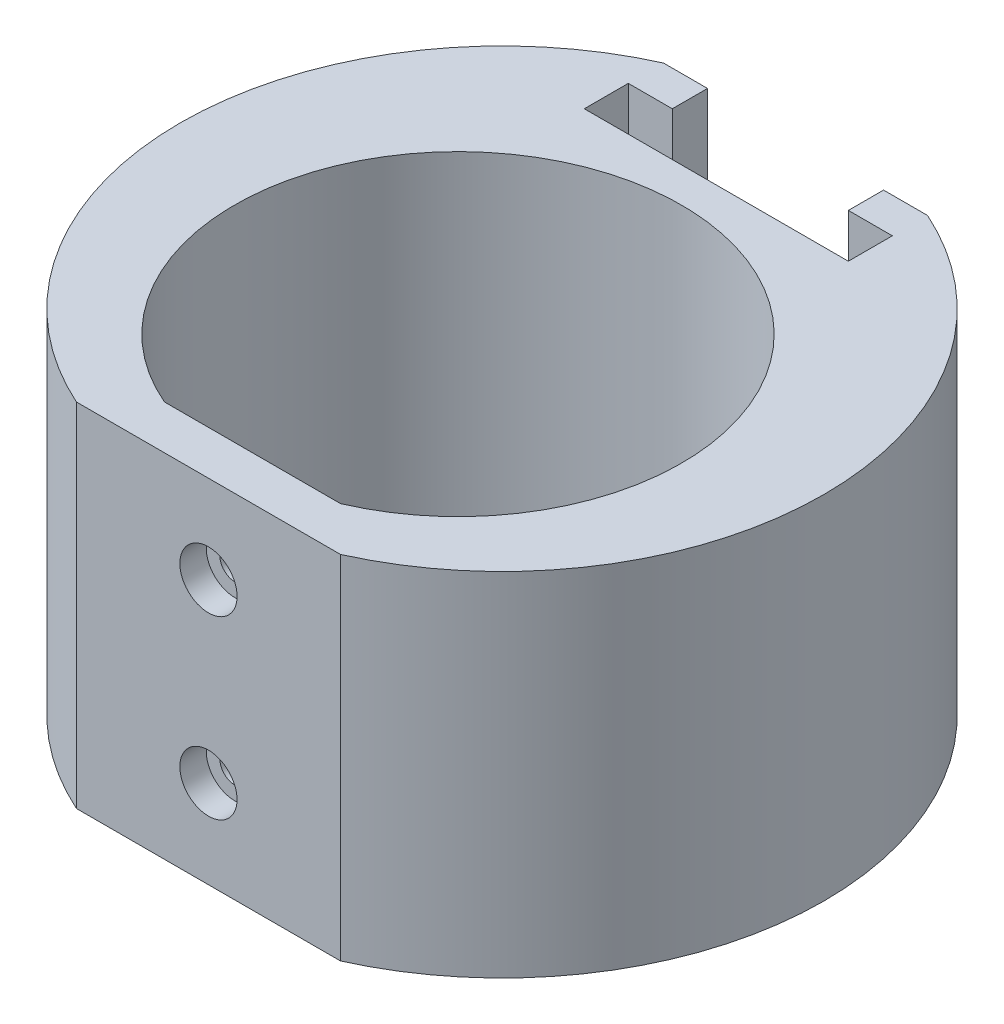
ISO-10303-21;
HEADER;
FILE_DESCRIPTION(('STEP AP214'),'2;1');
FILE_NAME('part.step','',(''),(''),'','','');
FILE_SCHEMA(('AUTOMOTIVE_DESIGN { 1 0 10303 214 1 1 1 1 }'));
ENDSEC;
DATA;
#1=APPLICATION_CONTEXT('core data for automotive mechanical design processes');
#2=APPLICATION_PROTOCOL_DEFINITION('international standard','automotive_design',2000,#1);
#3=PRODUCT_CONTEXT('',#1,'mechanical');
#4=PRODUCT('Part','Part','',(#3));
#5=PRODUCT_RELATED_PRODUCT_CATEGORY('part','',(#4));
#6=PRODUCT_DEFINITION_FORMATION('','',#4);
#7=PRODUCT_DEFINITION_CONTEXT('part definition',#1,'design');
#8=PRODUCT_DEFINITION('design','',#6,#7);
#9=PRODUCT_DEFINITION_SHAPE('','',#8);
#10=(LENGTH_UNIT() NAMED_UNIT(*) SI_UNIT(.MILLI.,.METRE.));
#11=(NAMED_UNIT(*) PLANE_ANGLE_UNIT() SI_UNIT($,.RADIAN.));
#12=(NAMED_UNIT(*) SI_UNIT($,.STERADIAN.) SOLID_ANGLE_UNIT());
#13=UNCERTAINTY_MEASURE_WITH_UNIT(LENGTH_MEASURE(1.E-05),#10,'distance_accuracy_value','');
#14=(GEOMETRIC_REPRESENTATION_CONTEXT(3) GLOBAL_UNCERTAINTY_ASSIGNED_CONTEXT((#13)) GLOBAL_UNIT_ASSIGNED_CONTEXT((#10,
#11,#12)) REPRESENTATION_CONTEXT('',''));
#15=CARTESIAN_POINT('',(0.,0.,0.));
#16=DIRECTION('',(0.,0.,1.));
#17=DIRECTION('',(1.,0.,0.));
#18=AXIS2_PLACEMENT_3D('',#15,#16,#17);
#19=CARTESIAN_POINT('',(0.,20.,-5.));
#20=DIRECTION('',(0.,1.,0.));
#21=DIRECTION('',(0.,0.,1.));
#22=AXIS2_PLACEMENT_3D('',#19,#20,#21);
#23=PLANE('',#22);
#24=DIRECTION('',(0.,0.,-1.));
#25=VECTOR('',#24,1.);
#26=CARTESIAN_POINT('',(10.,20.,-34.3486616318795));
#27=LINE('',#26,#25);
#28=CARTESIAN_POINT('',(10.,20.,-34.3486616318795));
#29=VERTEX_POINT('',#28);
#30=CARTESIAN_POINT('',(10.,20.,-38.3486616318795));
#31=VERTEX_POINT('',#30);
#32=EDGE_CURVE('E210',#29,#31,#27,.T.);
#33=ORIENTED_EDGE('',*,*,#32,.F.);
#34=DIRECTION('',(-1.,0.,0.));
#35=VECTOR('',#34,1.);
#36=CARTESIAN_POINT('',(15.,20.,-34.3486616318794));
#37=LINE('',#36,#35);
#38=CARTESIAN_POINT('',(15.,20.,-34.3486616318794));
#39=VERTEX_POINT('',#38);
#40=EDGE_CURVE('E233',#39,#29,#37,.T.);
#41=ORIENTED_EDGE('',*,*,#40,.F.);
#42=DIRECTION('',(0.,0.,-1.));
#43=VECTOR('',#42,1.);
#44=CARTESIAN_POINT('',(15.,20.,-29.3486616318794));
#45=LINE('',#44,#43);
#46=CARTESIAN_POINT('',(15.,20.,-29.3486616318794));
#47=VERTEX_POINT('',#46);
#48=EDGE_CURVE('E230',#47,#39,#45,.T.);
#49=ORIENTED_EDGE('',*,*,#48,.F.);
#50=DIRECTION('',(1.,0.,0.));
#51=VECTOR('',#50,1.);
#52=CARTESIAN_POINT('',(-15.,20.,-29.3486616318794));
#53=LINE('',#52,#51);
#54=CARTESIAN_POINT('',(-15.,20.,-29.3486616318794));
#55=VERTEX_POINT('',#54);
#56=EDGE_CURVE('E227',#55,#47,#53,.T.);
#57=ORIENTED_EDGE('',*,*,#56,.F.);
#58=DIRECTION('',(0.,0.,1.));
#59=VECTOR('',#58,1.);
#60=CARTESIAN_POINT('',(-15.,20.,-34.3486616318794));
#61=LINE('',#60,#59);
#62=CARTESIAN_POINT('',(-15.,20.,-34.3486616318794));
#63=VERTEX_POINT('',#62);
#64=EDGE_CURVE('E224',#63,#55,#61,.T.);
#65=ORIENTED_EDGE('',*,*,#64,.F.);
#66=DIRECTION('',(-1.,0.,0.));
#67=VECTOR('',#66,1.);
#68=CARTESIAN_POINT('',(-10.,20.,-34.3486616318795));
#69=LINE('',#68,#67);
#70=CARTESIAN_POINT('',(-10.,20.,-34.3486616318795));
#71=VERTEX_POINT('',#70);
#72=EDGE_CURVE('E221',#71,#63,#69,.T.);
#73=ORIENTED_EDGE('',*,*,#72,.F.);
#74=DIRECTION('',(0.,0.,1.));
#75=VECTOR('',#74,1.);
#76=CARTESIAN_POINT('',(-10.,20.,-38.3486616318795));
#77=LINE('',#76,#75);
#78=CARTESIAN_POINT('',(-10.,20.,-38.3486616318795));
#79=VERTEX_POINT('',#78);
#80=EDGE_CURVE('E205',#79,#71,#77,.T.);
#81=ORIENTED_EDGE('',*,*,#80,.F.);
#82=DIRECTION('',(-1.,0.,0.));
#83=VECTOR('',#82,1.);
#84=CARTESIAN_POINT('',(-15.,20.,-38.3486616318795));
#85=LINE('',#84,#83);
#86=CARTESIAN_POINT('',(-15.,20.,-38.3486616318795));
#87=VERTEX_POINT('',#86);
#88=EDGE_CURVE('E274',#79,#87,#85,.T.);
#89=ORIENTED_EDGE('',*,*,#88,.T.);
#90=CARTESIAN_POINT('',(0.,20.,-5.));
#91=DIRECTION('',(0.,1.,0.));
#92=DIRECTION('',(0.,0.,1.));
#93=AXIS2_PLACEMENT_3D('',#90,#91,#92);
#94=CIRCLE('',#93,36.5668324118673);
#95=CARTESIAN_POINT('',(-15.,20.,28.3486616318795));
#96=VERTEX_POINT('',#95);
#97=EDGE_CURVE('E279',#87,#96,#94,.T.);
#98=ORIENTED_EDGE('',*,*,#97,.T.);
#99=DIRECTION('',(1.,0.,0.));
#100=VECTOR('',#99,1.);
#101=CARTESIAN_POINT('',(-15.,20.,28.3486616318795));
#102=LINE('',#101,#100);
#103=CARTESIAN_POINT('',(15.,20.,28.3486616318795));
#104=VERTEX_POINT('',#103);
#105=EDGE_CURVE('E281',#96,#104,#102,.T.);
#106=ORIENTED_EDGE('',*,*,#105,.T.);
#107=CARTESIAN_POINT('',(0.,20.,-5.));
#108=DIRECTION('',(0.,1.,0.));
#109=DIRECTION('',(0.,0.,1.));
#110=AXIS2_PLACEMENT_3D('',#107,#108,#109);
#111=CIRCLE('',#110,36.5668324118673);
#112=CARTESIAN_POINT('',(15.,20.,-38.3486616318795));
#113=VERTEX_POINT('',#112);
#114=EDGE_CURVE('E271',#104,#113,#111,.T.);
#115=ORIENTED_EDGE('',*,*,#114,.T.);
#116=EDGE_CURVE('E276',#113,#31,#85,.T.);
#117=ORIENTED_EDGE('',*,*,#116,.T.);
#118=EDGE_LOOP('',(#33,#41,#49,#57,#65,#73,#81,#89,#98,#106,#115,#117));
#119=FACE_BOUND('',#118,.T.);
#120=DIRECTION('',(1.,0.,0.));
#121=VECTOR('',#120,1.);
#122=CARTESIAN_POINT('',(-10.,20.,23.3486616318795));
#123=LINE('',#122,#121);
#124=CARTESIAN_POINT('',(-10.,20.,23.3486616318795));
#125=VERTEX_POINT('',#124);
#126=CARTESIAN_POINT('',(10.,20.,23.3486616318795));
#127=VERTEX_POINT('',#126);
#128=EDGE_CURVE('E257',#125,#127,#123,.T.);
#129=ORIENTED_EDGE('',*,*,#128,.F.);
#130=CARTESIAN_POINT('',(0.,20.,0.));
#131=DIRECTION('',(0.,1.,0.));
#132=DIRECTION('',(0.,0.,1.));
#133=AXIS2_PLACEMENT_3D('',#130,#131,#132);
#134=CIRCLE('',#133,25.4);
#135=EDGE_CURVE('E254',#127,#125,#134,.T.);
#136=ORIENTED_EDGE('',*,*,#135,.F.);
#137=EDGE_LOOP('',(#129,#136));
#138=FACE_BOUND('',#137,.T.);
#139=ADVANCED_FACE('F42',(#119,#138),#23,.T.);
#140=CARTESIAN_POINT('',(0.,-20.,-5.));
#141=DIRECTION('',(0.,1.,0.));
#142=DIRECTION('',(0.,0.,1.));
#143=AXIS2_PLACEMENT_3D('',#140,#141,#142);
#144=PLANE('',#143);
#145=CARTESIAN_POINT('',(0.,-20.,-5.));
#146=DIRECTION('',(0.,1.,0.));
#147=DIRECTION('',(0.,0.,1.));
#148=AXIS2_PLACEMENT_3D('',#145,#146,#147);
#149=CIRCLE('',#148,36.5668324118673);
#150=CARTESIAN_POINT('',(15.,-20.,28.3486616318795));
#151=VERTEX_POINT('',#150);
#152=CARTESIAN_POINT('',(15.,-20.,-38.3486616318795));
#153=VERTEX_POINT('',#152);
#154=EDGE_CURVE('E270',#151,#153,#149,.T.);
#155=ORIENTED_EDGE('',*,*,#154,.F.);
#156=DIRECTION('',(1.,0.,0.));
#157=VECTOR('',#156,1.);
#158=CARTESIAN_POINT('',(-15.,-20.,28.3486616318795));
#159=LINE('',#158,#157);
#160=CARTESIAN_POINT('',(-15.,-20.,28.3486616318795));
#161=VERTEX_POINT('',#160);
#162=EDGE_CURVE('E275',#161,#151,#159,.T.);
#163=ORIENTED_EDGE('',*,*,#162,.F.);
#164=CARTESIAN_POINT('',(0.,-20.,-5.));
#165=DIRECTION('',(0.,1.,0.));
#166=DIRECTION('',(0.,0.,1.));
#167=AXIS2_PLACEMENT_3D('',#164,#165,#166);
#168=CIRCLE('',#167,36.5668324118673);
#169=CARTESIAN_POINT('',(-15.,-20.,-38.3486616318795));
#170=VERTEX_POINT('',#169);
#171=EDGE_CURVE('E288',#170,#161,#168,.T.);
#172=ORIENTED_EDGE('',*,*,#171,.F.);
#173=DIRECTION('',(-1.,0.,0.));
#174=VECTOR('',#173,1.);
#175=CARTESIAN_POINT('',(-15.,-20.,-38.3486616318795));
#176=LINE('',#175,#174);
#177=EDGE_CURVE('E286',#153,#170,#176,.T.);
#178=ORIENTED_EDGE('',*,*,#177,.F.);
#179=EDGE_LOOP('',(#155,#163,#172,#178));
#180=FACE_BOUND('',#179,.T.);
#181=CARTESIAN_POINT('',(0.,-20.,0.));
#182=DIRECTION('',(0.,1.,0.));
#183=DIRECTION('',(0.,0.,1.));
#184=AXIS2_PLACEMENT_3D('',#181,#182,#183);
#185=CIRCLE('',#184,25.4);
#186=CARTESIAN_POINT('',(10.,-20.,23.3486616318795));
#187=VERTEX_POINT('',#186);
#188=CARTESIAN_POINT('',(-10.,-20.,23.3486616318795));
#189=VERTEX_POINT('',#188);
#190=EDGE_CURVE('E240',#187,#189,#185,.T.);
#191=ORIENTED_EDGE('',*,*,#190,.T.);
#192=DIRECTION('',(1.,0.,0.));
#193=VECTOR('',#192,1.);
#194=CARTESIAN_POINT('',(-10.,-20.,23.3486616318795));
#195=LINE('',#194,#193);
#196=EDGE_CURVE('E258',#189,#187,#195,.T.);
#197=ORIENTED_EDGE('',*,*,#196,.T.);
#198=EDGE_LOOP('',(#191,#197));
#199=FACE_BOUND('',#198,.T.);
#200=ADVANCED_FACE('F375',(#180,#199),#144,.F.);
#201=CARTESIAN_POINT('',(0.,20.,-5.));
#202=DIRECTION('',(0.,-1.,0.));
#203=DIRECTION('',(0.,0.,-1.));
#204=AXIS2_PLACEMENT_3D('',#201,#202,#203);
#205=CYLINDRICAL_SURFACE('',#204,36.5668324118673);
#206=ORIENTED_EDGE('',*,*,#154,.T.);
#207=DIRECTION('',(0.,-1.,0.));
#208=VECTOR('',#207,1.);
#209=CARTESIAN_POINT('',(15.,20.,-38.3486616318795));
#210=LINE('',#209,#208);
#211=EDGE_CURVE('E299',#113,#153,#210,.T.);
#212=ORIENTED_EDGE('',*,*,#211,.F.);
#213=ORIENTED_EDGE('',*,*,#114,.F.);
#214=DIRECTION('',(0.,-1.,0.));
#215=VECTOR('',#214,1.);
#216=CARTESIAN_POINT('',(15.,20.,28.3486616318795));
#217=LINE('',#216,#215);
#218=EDGE_CURVE('E283',#104,#151,#217,.T.);
#219=ORIENTED_EDGE('',*,*,#218,.T.);
#220=EDGE_LOOP('',(#206,#212,#213,#219));
#221=FACE_BOUND('',#220,.T.);
#222=ADVANCED_FACE('F371',(#221),#205,.T.);
#223=CARTESIAN_POINT('',(-15.,20.,-38.3486616318795));
#224=DIRECTION('',(0.,0.,1.));
#225=DIRECTION('',(1.,0.,0.));
#226=AXIS2_PLACEMENT_3D('',#223,#224,#225);
#227=PLANE('',#226);
#228=DIRECTION('',(-1.,0.,0.));
#229=VECTOR('',#228,1.);
#230=CARTESIAN_POINT('',(-10.,-7.5,-38.3486616318795));
#231=LINE('',#230,#229);
#232=CARTESIAN_POINT('',(6.,-7.5,-38.3486616318795));
#233=VERTEX_POINT('',#232);
#234=CARTESIAN_POINT('',(-6.,-7.5,-38.3486616318795));
#235=VERTEX_POINT('',#234);
#236=EDGE_CURVE('E206',#233,#235,#231,.T.);
#237=ORIENTED_EDGE('',*,*,#236,.F.);
#238=CARTESIAN_POINT('',(6.,-3.5,-38.3486616318795));
#239=DIRECTION('',(0.,0.,1.));
#240=DIRECTION('',(1.,0.,0.));
#241=AXIS2_PLACEMENT_3D('',#238,#239,#240);
#242=CIRCLE('',#241,4.);
#243=CARTESIAN_POINT('',(10.,-3.5,-38.3486616318795));
#244=VERTEX_POINT('',#243);
#245=EDGE_CURVE('E328',#233,#244,#242,.T.);
#246=ORIENTED_EDGE('',*,*,#245,.T.);
#247=DIRECTION('',(0.,1.,0.));
#248=VECTOR('',#247,1.);
#249=CARTESIAN_POINT('',(10.,-7.5,-38.3486616318795));
#250=LINE('',#249,#248);
#251=EDGE_CURVE('E238',#244,#31,#250,.T.);
#252=ORIENTED_EDGE('',*,*,#251,.T.);
#253=ORIENTED_EDGE('',*,*,#116,.F.);
#254=ORIENTED_EDGE('',*,*,#211,.T.);
#255=ORIENTED_EDGE('',*,*,#177,.T.);
#256=DIRECTION('',(0.,-1.,0.));
#257=VECTOR('',#256,1.);
#258=CARTESIAN_POINT('',(-15.,20.,-38.3486616318795));
#259=LINE('',#258,#257);
#260=EDGE_CURVE('E296',#87,#170,#259,.T.);
#261=ORIENTED_EDGE('',*,*,#260,.F.);
#262=ORIENTED_EDGE('',*,*,#88,.F.);
#263=DIRECTION('',(0.,1.,0.));
#264=VECTOR('',#263,1.);
#265=CARTESIAN_POINT('',(-10.,-7.5,-38.3486616318795));
#266=LINE('',#265,#264);
#267=CARTESIAN_POINT('',(-10.,-3.5,-38.3486616318795));
#268=VERTEX_POINT('',#267);
#269=EDGE_CURVE('E218',#268,#79,#266,.T.);
#270=ORIENTED_EDGE('',*,*,#269,.F.);
#271=CARTESIAN_POINT('',(-6.,-3.5,-38.3486616318795));
#272=DIRECTION('',(0.,0.,1.));
#273=DIRECTION('',(1.,0.,0.));
#274=AXIS2_PLACEMENT_3D('',#271,#272,#273);
#275=CIRCLE('',#274,4.);
#276=EDGE_CURVE('E11',#268,#235,#275,.T.);
#277=ORIENTED_EDGE('',*,*,#276,.T.);
#278=EDGE_LOOP('',(#237,#246,#252,#253,#254,#255,#261,#262,#270,#277));
#279=FACE_BOUND('',#278,.T.);
#280=ADVANCED_FACE('F349',(#279),#227,.F.);
#281=CARTESIAN_POINT('',(0.,20.,-5.));
#282=DIRECTION('',(0.,-1.,0.));
#283=DIRECTION('',(0.,0.,-1.));
#284=AXIS2_PLACEMENT_3D('',#281,#282,#283);
#285=CYLINDRICAL_SURFACE('',#284,36.5668324118673);
#286=ORIENTED_EDGE('',*,*,#171,.T.);
#287=DIRECTION('',(0.,-1.,0.));
#288=VECTOR('',#287,1.);
#289=CARTESIAN_POINT('',(-15.,20.,28.3486616318795));
#290=LINE('',#289,#288);
#291=EDGE_CURVE('E293',#96,#161,#290,.T.);
#292=ORIENTED_EDGE('',*,*,#291,.F.);
#293=ORIENTED_EDGE('',*,*,#97,.F.);
#294=ORIENTED_EDGE('',*,*,#260,.T.);
#295=EDGE_LOOP('',(#286,#292,#293,#294));
#296=FACE_BOUND('',#295,.T.);
#297=ADVANCED_FACE('F380',(#296),#285,.T.);
#298=CARTESIAN_POINT('',(-15.,20.,28.3486616318795));
#299=DIRECTION('',(0.,0.,-1.));
#300=DIRECTION('',(-1.,0.,0.));
#301=AXIS2_PLACEMENT_3D('',#298,#299,#300);
#302=PLANE('',#301);
#303=CARTESIAN_POINT('',(0.,10.,28.3486616318795));
#304=DIRECTION('',(0.,0.,1.));
#305=DIRECTION('',(1.,0.,0.));
#306=AXIS2_PLACEMENT_3D('',#303,#304,#305);
#307=CIRCLE('',#306,3.25);
#308=CARTESIAN_POINT('',(3.25,10.,28.3486616318795));
#309=VERTEX_POINT('',#308);
#310=EDGE_CURVE('E180',#309,#309,#307,.T.);
#311=ORIENTED_EDGE('',*,*,#310,.F.);
#312=EDGE_LOOP('',(#311));
#313=FACE_BOUND('',#312,.T.);
#314=CARTESIAN_POINT('',(0.,-10.,28.3486616318795));
#315=DIRECTION('',(0.,0.,1.));
#316=DIRECTION('',(1.,0.,0.));
#317=AXIS2_PLACEMENT_3D('',#314,#315,#316);
#318=CIRCLE('',#317,3.25);
#319=CARTESIAN_POINT('',(3.25,-10.,28.3486616318795));
#320=VERTEX_POINT('',#319);
#321=EDGE_CURVE('E193',#320,#320,#318,.T.);
#322=ORIENTED_EDGE('',*,*,#321,.F.);
#323=EDGE_LOOP('',(#322));
#324=FACE_BOUND('',#323,.T.);
#325=ORIENTED_EDGE('',*,*,#162,.T.);
#326=ORIENTED_EDGE('',*,*,#218,.F.);
#327=ORIENTED_EDGE('',*,*,#105,.F.);
#328=ORIENTED_EDGE('',*,*,#291,.T.);
#329=EDGE_LOOP('',(#325,#326,#327,#328));
#330=FACE_BOUND('',#329,.T.);
#331=ADVANCED_FACE('F384',(#313,#324,#330),#302,.F.);
#332=CARTESIAN_POINT('',(0.,20.,0.));
#333=DIRECTION('',(0.,-1.,0.));
#334=DIRECTION('',(0.,0.,-1.));
#335=AXIS2_PLACEMENT_3D('',#332,#333,#334);
#336=CYLINDRICAL_SURFACE('',#335,25.4);
#337=ORIENTED_EDGE('',*,*,#190,.F.);
#338=DIRECTION('',(0.,-1.,0.));
#339=VECTOR('',#338,1.);
#340=CARTESIAN_POINT('',(10.,20.,23.3486616318795));
#341=LINE('',#340,#339);
#342=EDGE_CURVE('E260',#127,#187,#341,.T.);
#343=ORIENTED_EDGE('',*,*,#342,.F.);
#344=ORIENTED_EDGE('',*,*,#135,.T.);
#345=DIRECTION('',(0.,-1.,0.));
#346=VECTOR('',#345,1.);
#347=CARTESIAN_POINT('',(-10.,20.,23.3486616318795));
#348=LINE('',#347,#346);
#349=EDGE_CURVE('E267',#125,#189,#348,.T.);
#350=ORIENTED_EDGE('',*,*,#349,.T.);
#351=EDGE_LOOP('',(#337,#343,#344,#350));
#352=FACE_BOUND('',#351,.T.);
#353=ADVANCED_FACE('F421',(#352),#336,.F.);
#354=CARTESIAN_POINT('',(-10.,20.,23.3486616318795));
#355=DIRECTION('',(0.,0.,-1.));
#356=DIRECTION('',(-1.,0.,0.));
#357=AXIS2_PLACEMENT_3D('',#354,#355,#356);
#358=PLANE('',#357);
#359=CARTESIAN_POINT('',(0.,10.,23.3486616318795));
#360=DIRECTION('',(0.,0.,-1.));
#361=DIRECTION('',(-1.,0.,0.));
#362=AXIS2_PLACEMENT_3D('',#359,#360,#361);
#363=CIRCLE('',#362,1.7);
#364=CARTESIAN_POINT('',(-1.7,10.,23.3486616318795));
#365=VERTEX_POINT('',#364);
#366=EDGE_CURVE('E190',#365,#365,#363,.T.);
#367=ORIENTED_EDGE('',*,*,#366,.F.);
#368=EDGE_LOOP('',(#367));
#369=FACE_BOUND('',#368,.T.);
#370=CARTESIAN_POINT('',(0.,-10.,23.3486616318795));
#371=DIRECTION('',(0.,0.,-1.));
#372=DIRECTION('',(-1.,0.,0.));
#373=AXIS2_PLACEMENT_3D('',#370,#371,#372);
#374=CIRCLE('',#373,1.7);
#375=CARTESIAN_POINT('',(-1.69999999999999,-10.,23.3486616318795));
#376=VERTEX_POINT('',#375);
#377=EDGE_CURVE('E202',#376,#376,#374,.T.);
#378=ORIENTED_EDGE('',*,*,#377,.F.);
#379=EDGE_LOOP('',(#378));
#380=FACE_BOUND('',#379,.T.);
#381=ORIENTED_EDGE('',*,*,#196,.F.);
#382=ORIENTED_EDGE('',*,*,#349,.F.);
#383=ORIENTED_EDGE('',*,*,#128,.T.);
#384=ORIENTED_EDGE('',*,*,#342,.T.);
#385=EDGE_LOOP('',(#381,#382,#383,#384));
#386=FACE_BOUND('',#385,.T.);
#387=ADVANCED_FACE('F460',(#369,#380,#386),#358,.T.);
#388=CARTESIAN_POINT('',(10.,-7.5,-34.3486616318795));
#389=DIRECTION('',(1.,0.,0.));
#390=DIRECTION('',(0.,0.,-1.));
#391=AXIS2_PLACEMENT_3D('',#388,#389,#390);
#392=PLANE('',#391);
#393=ORIENTED_EDGE('',*,*,#251,.F.);
#394=DIRECTION('',(0.,0.,-1.));
#395=VECTOR('',#394,1.);
#396=CARTESIAN_POINT('',(10.,-3.5,-34.3486616318795));
#397=LINE('',#396,#395);
#398=CARTESIAN_POINT('',(10.,-3.5,-34.3486616318795));
#399=VERTEX_POINT('',#398);
#400=EDGE_CURVE('E314',#244,#399,#397,.F.);
#401=ORIENTED_EDGE('',*,*,#400,.T.);
#402=DIRECTION('',(0.,1.,0.));
#403=VECTOR('',#402,1.);
#404=CARTESIAN_POINT('',(10.,-7.5,-34.3486616318795));
#405=LINE('',#404,#403);
#406=EDGE_CURVE('E241',#399,#29,#405,.T.);
#407=ORIENTED_EDGE('',*,*,#406,.T.);
#408=ORIENTED_EDGE('',*,*,#32,.T.);
#409=EDGE_LOOP('',(#393,#401,#407,#408));
#410=FACE_BOUND('',#409,.T.);
#411=ADVANCED_FACE('F360',(#410),#392,.F.);
#412=CARTESIAN_POINT('',(15.,-7.5,-34.3486616318794));
#413=DIRECTION('',(0.,0.,-1.));
#414=DIRECTION('',(-1.,0.,0.));
#415=AXIS2_PLACEMENT_3D('',#412,#413,#414);
#416=PLANE('',#415);
#417=DIRECTION('',(-1.,0.,0.));
#418=VECTOR('',#417,1.);
#419=CARTESIAN_POINT('',(15.,-7.5,-34.3486616318794));
#420=LINE('',#419,#418);
#421=CARTESIAN_POINT('',(11.,-7.5,-34.3486616318795));
#422=VERTEX_POINT('',#421);
#423=CARTESIAN_POINT('',(6.,-7.5,-34.3486616318795));
#424=VERTEX_POINT('',#423);
#425=EDGE_CURVE('E216',#422,#424,#420,.T.);
#426=ORIENTED_EDGE('',*,*,#425,.F.);
#427=CARTESIAN_POINT('',(11.,-3.5,-34.3486616318795));
#428=DIRECTION('',(0.,0.,-1.));
#429=DIRECTION('',(-1.,0.,0.));
#430=AXIS2_PLACEMENT_3D('',#427,#428,#429);
#431=CIRCLE('',#430,4.);
#432=CARTESIAN_POINT('',(15.,-3.5,-34.3486616318794));
#433=VERTEX_POINT('',#432);
#434=EDGE_CURVE('E58',#422,#433,#431,.F.);
#435=ORIENTED_EDGE('',*,*,#434,.T.);
#436=DIRECTION('',(0.,1.,0.));
#437=VECTOR('',#436,1.);
#438=CARTESIAN_POINT('',(15.,-7.5,-34.3486616318794));
#439=LINE('',#438,#437);
#440=EDGE_CURVE('E243',#433,#39,#439,.T.);
#441=ORIENTED_EDGE('',*,*,#440,.T.);
#442=ORIENTED_EDGE('',*,*,#40,.T.);
#443=ORIENTED_EDGE('',*,*,#406,.F.);
#444=CARTESIAN_POINT('',(6.,-3.5,-34.3486616318795));
#445=DIRECTION('',(0.,0.,-1.));
#446=DIRECTION('',(-1.,0.,0.));
#447=AXIS2_PLACEMENT_3D('',#444,#445,#446);
#448=CIRCLE('',#447,4.);
#449=EDGE_CURVE('E330',#399,#424,#448,.T.);
#450=ORIENTED_EDGE('',*,*,#449,.T.);
#451=EDGE_LOOP('',(#426,#435,#441,#442,#443,#450));
#452=FACE_BOUND('',#451,.T.);
#453=ADVANCED_FACE('F399',(#452),#416,.F.);
#454=CARTESIAN_POINT('',(15.,-7.5,-29.3486616318794));
#455=DIRECTION('',(1.,0.,0.));
#456=DIRECTION('',(0.,0.,-1.));
#457=AXIS2_PLACEMENT_3D('',#454,#455,#456);
#458=PLANE('',#457);
#459=ORIENTED_EDGE('',*,*,#440,.F.);
#460=DIRECTION('',(0.,0.,-1.));
#461=VECTOR('',#460,1.);
#462=CARTESIAN_POINT('',(15.,-3.5,-29.3486616318794));
#463=LINE('',#462,#461);
#464=CARTESIAN_POINT('',(15.,-3.5,-29.3486616318794));
#465=VERTEX_POINT('',#464);
#466=EDGE_CURVE('E326',#433,#465,#463,.F.);
#467=ORIENTED_EDGE('',*,*,#466,.T.);
#468=DIRECTION('',(0.,1.,0.));
#469=VECTOR('',#468,1.);
#470=CARTESIAN_POINT('',(15.,-7.5,-29.3486616318794));
#471=LINE('',#470,#469);
#472=EDGE_CURVE('E245',#465,#47,#471,.T.);
#473=ORIENTED_EDGE('',*,*,#472,.T.);
#474=ORIENTED_EDGE('',*,*,#48,.T.);
#475=EDGE_LOOP('',(#459,#467,#473,#474));
#476=FACE_BOUND('',#475,.T.);
#477=ADVANCED_FACE('F402',(#476),#458,.F.);
#478=CARTESIAN_POINT('',(-15.,-7.5,-29.3486616318794));
#479=DIRECTION('',(0.,0.,1.));
#480=DIRECTION('',(1.,0.,0.));
#481=AXIS2_PLACEMENT_3D('',#478,#479,#480);
#482=PLANE('',#481);
#483=CARTESIAN_POINT('',(0.,13.9087512097831,-29.3486616318794));
#484=DIRECTION('',(0.,0.,1.));
#485=DIRECTION('',(1.,0.,0.));
#486=AXIS2_PLACEMENT_3D('',#483,#484,#485);
#487=CIRCLE('',#486,1.24999999999999);
#488=CARTESIAN_POINT('',(1.25,13.9087512097831,-29.3486616318794));
#489=VERTEX_POINT('',#488);
#490=EDGE_CURVE('E46',#489,#489,#487,.T.);
#491=ORIENTED_EDGE('',*,*,#490,.T.);
#492=EDGE_LOOP('',(#491));
#493=FACE_BOUND('',#492,.T.);
#494=DIRECTION('',(1.,0.,0.));
#495=VECTOR('',#494,1.);
#496=CARTESIAN_POINT('',(-15.,-7.5,-29.3486616318794));
#497=LINE('',#496,#495);
#498=CARTESIAN_POINT('',(-11.,-7.5,-29.3486616318794));
#499=VERTEX_POINT('',#498);
#500=CARTESIAN_POINT('',(11.,-7.5,-29.3486616318794));
#501=VERTEX_POINT('',#500);
#502=EDGE_CURVE('E213',#499,#501,#497,.T.);
#503=ORIENTED_EDGE('',*,*,#502,.F.);
#504=CARTESIAN_POINT('',(-11.,-3.5,-29.3486616318794));
#505=DIRECTION('',(0.,0.,1.));
#506=DIRECTION('',(1.,0.,0.));
#507=AXIS2_PLACEMENT_3D('',#504,#505,#506);
#508=CIRCLE('',#507,4.);
#509=CARTESIAN_POINT('',(-15.,-3.5,-29.3486616318794));
#510=VERTEX_POINT('',#509);
#511=EDGE_CURVE('E320',#499,#510,#508,.F.);
#512=ORIENTED_EDGE('',*,*,#511,.T.);
#513=DIRECTION('',(0.,1.,0.));
#514=VECTOR('',#513,1.);
#515=CARTESIAN_POINT('',(-15.,-7.5,-29.3486616318794));
#516=LINE('',#515,#514);
#517=EDGE_CURVE('E247',#510,#55,#516,.T.);
#518=ORIENTED_EDGE('',*,*,#517,.T.);
#519=ORIENTED_EDGE('',*,*,#56,.T.);
#520=ORIENTED_EDGE('',*,*,#472,.F.);
#521=CARTESIAN_POINT('',(11.,-3.5,-29.3486616318794));
#522=DIRECTION('',(0.,0.,1.));
#523=DIRECTION('',(1.,0.,0.));
#524=AXIS2_PLACEMENT_3D('',#521,#522,#523);
#525=CIRCLE('',#524,4.);
#526=EDGE_CURVE('E318',#465,#501,#525,.F.);
#527=ORIENTED_EDGE('',*,*,#526,.T.);
#528=EDGE_LOOP('',(#503,#512,#518,#519,#520,#527));
#529=FACE_BOUND('',#528,.T.);
#530=ADVANCED_FACE('F394',(#493,#529),#482,.F.);
#531=CARTESIAN_POINT('',(-15.,-7.5,-34.3486616318794));
#532=DIRECTION('',(-1.,0.,0.));
#533=DIRECTION('',(0.,0.,1.));
#534=AXIS2_PLACEMENT_3D('',#531,#532,#533);
#535=PLANE('',#534);
#536=ORIENTED_EDGE('',*,*,#517,.F.);
#537=DIRECTION('',(0.,0.,1.));
#538=VECTOR('',#537,1.);
#539=CARTESIAN_POINT('',(-15.,-3.5,-34.3486616318794));
#540=LINE('',#539,#538);
#541=CARTESIAN_POINT('',(-15.,-3.5,-34.3486616318794));
#542=VERTEX_POINT('',#541);
#543=EDGE_CURVE('E66',#510,#542,#540,.F.);
#544=ORIENTED_EDGE('',*,*,#543,.T.);
#545=DIRECTION('',(0.,1.,0.));
#546=VECTOR('',#545,1.);
#547=CARTESIAN_POINT('',(-15.,-7.5,-34.3486616318794));
#548=LINE('',#547,#546);
#549=EDGE_CURVE('E249',#542,#63,#548,.T.);
#550=ORIENTED_EDGE('',*,*,#549,.T.);
#551=ORIENTED_EDGE('',*,*,#64,.T.);
#552=EDGE_LOOP('',(#536,#544,#550,#551));
#553=FACE_BOUND('',#552,.T.);
#554=ADVANCED_FACE('F403',(#553),#535,.F.);
#555=CARTESIAN_POINT('',(-10.,-7.5,-34.3486616318795));
#556=DIRECTION('',(0.,0.,-1.));
#557=DIRECTION('',(-1.,0.,0.));
#558=AXIS2_PLACEMENT_3D('',#555,#556,#557);
#559=PLANE('',#558);
#560=ORIENTED_EDGE('',*,*,#549,.F.);
#561=CARTESIAN_POINT('',(-11.,-3.5,-34.3486616318795));
#562=DIRECTION('',(0.,0.,-1.));
#563=DIRECTION('',(-1.,0.,0.));
#564=AXIS2_PLACEMENT_3D('',#561,#562,#563);
#565=CIRCLE('',#564,4.);
#566=CARTESIAN_POINT('',(-11.,-7.5,-34.3486616318795));
#567=VERTEX_POINT('',#566);
#568=EDGE_CURVE('E323',#542,#567,#565,.F.);
#569=ORIENTED_EDGE('',*,*,#568,.T.);
#570=DIRECTION('',(-1.,0.,0.));
#571=VECTOR('',#570,1.);
#572=CARTESIAN_POINT('',(-10.,-7.5,-34.3486616318795));
#573=LINE('',#572,#571);
#574=CARTESIAN_POINT('',(-6.,-7.5,-34.3486616318795));
#575=VERTEX_POINT('',#574);
#576=EDGE_CURVE('E209',#575,#567,#573,.T.);
#577=ORIENTED_EDGE('',*,*,#576,.F.);
#578=CARTESIAN_POINT('',(-6.,-3.5,-34.3486616318795));
#579=DIRECTION('',(0.,0.,-1.));
#580=DIRECTION('',(-1.,0.,0.));
#581=AXIS2_PLACEMENT_3D('',#578,#579,#580);
#582=CIRCLE('',#581,4.);
#583=CARTESIAN_POINT('',(-10.,-3.5,-34.3486616318795));
#584=VERTEX_POINT('',#583);
#585=EDGE_CURVE('E51',#575,#584,#582,.T.);
#586=ORIENTED_EDGE('',*,*,#585,.T.);
#587=DIRECTION('',(0.,1.,0.));
#588=VECTOR('',#587,1.);
#589=CARTESIAN_POINT('',(-10.,-7.5,-34.3486616318795));
#590=LINE('',#589,#588);
#591=EDGE_CURVE('E251',#584,#71,#590,.T.);
#592=ORIENTED_EDGE('',*,*,#591,.T.);
#593=ORIENTED_EDGE('',*,*,#72,.T.);
#594=EDGE_LOOP('',(#560,#569,#577,#586,#592,#593));
#595=FACE_BOUND('',#594,.T.);
#596=ADVANCED_FACE('F336',(#595),#559,.F.);
#597=CARTESIAN_POINT('',(-10.,-7.5,-38.3486616318795));
#598=DIRECTION('',(-1.,0.,0.));
#599=DIRECTION('',(0.,0.,1.));
#600=AXIS2_PLACEMENT_3D('',#597,#598,#599);
#601=PLANE('',#600);
#602=ORIENTED_EDGE('',*,*,#591,.F.);
#603=DIRECTION('',(0.,0.,1.));
#604=VECTOR('',#603,1.);
#605=CARTESIAN_POINT('',(-10.,-3.5,-38.3486616318795));
#606=LINE('',#605,#604);
#607=EDGE_CURVE('E316',#584,#268,#606,.F.);
#608=ORIENTED_EDGE('',*,*,#607,.T.);
#609=ORIENTED_EDGE('',*,*,#269,.T.);
#610=ORIENTED_EDGE('',*,*,#80,.T.);
#611=EDGE_LOOP('',(#602,#608,#609,#610));
#612=FACE_BOUND('',#611,.T.);
#613=ADVANCED_FACE('F341',(#612),#601,.F.);
#614=CARTESIAN_POINT('',(0.,-7.5,0.));
#615=DIRECTION('',(0.,1.,0.));
#616=DIRECTION('',(0.,0.,1.));
#617=AXIS2_PLACEMENT_3D('',#614,#615,#616);
#618=PLANE('',#617);
#619=ORIENTED_EDGE('',*,*,#425,.T.);
#620=DIRECTION('',(0.,0.,-1.));
#621=VECTOR('',#620,1.);
#622=CARTESIAN_POINT('',(6.,-7.5,0.));
#623=LINE('',#622,#621);
#624=EDGE_CURVE('E311',#424,#233,#623,.T.);
#625=ORIENTED_EDGE('',*,*,#624,.T.);
#626=ORIENTED_EDGE('',*,*,#236,.T.);
#627=DIRECTION('',(0.,0.,1.));
#628=VECTOR('',#627,1.);
#629=CARTESIAN_POINT('',(-6.,-7.5,0.));
#630=LINE('',#629,#628);
#631=EDGE_CURVE('E308',#235,#575,#630,.T.);
#632=ORIENTED_EDGE('',*,*,#631,.T.);
#633=ORIENTED_EDGE('',*,*,#576,.T.);
#634=DIRECTION('',(0.,0.,1.));
#635=VECTOR('',#634,1.);
#636=CARTESIAN_POINT('',(-11.,-7.5,0.));
#637=LINE('',#636,#635);
#638=EDGE_CURVE('E305',#567,#499,#637,.T.);
#639=ORIENTED_EDGE('',*,*,#638,.T.);
#640=ORIENTED_EDGE('',*,*,#502,.T.);
#641=DIRECTION('',(0.,0.,-1.));
#642=VECTOR('',#641,1.);
#643=CARTESIAN_POINT('',(11.,-7.5,0.));
#644=LINE('',#643,#642);
#645=EDGE_CURVE('E302',#501,#422,#644,.T.);
#646=ORIENTED_EDGE('',*,*,#645,.T.);
#647=EDGE_LOOP('',(#619,#625,#626,#632,#633,#639,#640,#646));
#648=FACE_BOUND('',#647,.T.);
#649=ADVANCED_FACE('F352',(#648),#618,.T.);
#650=CARTESIAN_POINT('',(6.,-3.5,0.));
#651=DIRECTION('',(0.,0.,-1.));
#652=DIRECTION('',(-1.,0.,0.));
#653=AXIS2_PLACEMENT_3D('',#650,#651,#652);
#654=CYLINDRICAL_SURFACE('',#653,4.);
#655=ORIENTED_EDGE('',*,*,#449,.F.);
#656=ORIENTED_EDGE('',*,*,#400,.F.);
#657=ORIENTED_EDGE('',*,*,#245,.F.);
#658=ORIENTED_EDGE('',*,*,#624,.F.);
#659=EDGE_LOOP('',(#655,#656,#657,#658));
#660=FACE_BOUND('',#659,.T.);
#661=ADVANCED_FACE('F356',(#660),#654,.F.);
#662=CARTESIAN_POINT('',(-6.,-3.5,0.));
#663=DIRECTION('',(0.,0.,1.));
#664=DIRECTION('',(1.,0.,0.));
#665=AXIS2_PLACEMENT_3D('',#662,#663,#664);
#666=CYLINDRICAL_SURFACE('',#665,4.);
#667=ORIENTED_EDGE('',*,*,#276,.F.);
#668=ORIENTED_EDGE('',*,*,#607,.F.);
#669=ORIENTED_EDGE('',*,*,#585,.F.);
#670=ORIENTED_EDGE('',*,*,#631,.F.);
#671=EDGE_LOOP('',(#667,#668,#669,#670));
#672=FACE_BOUND('',#671,.T.);
#673=ADVANCED_FACE('F346',(#672),#666,.F.);
#674=CARTESIAN_POINT('',(-11.,-3.5,0.));
#675=DIRECTION('',(0.,0.,1.));
#676=DIRECTION('',(1.,0.,0.));
#677=AXIS2_PLACEMENT_3D('',#674,#675,#676);
#678=CYLINDRICAL_SURFACE('',#677,4.);
#679=ORIENTED_EDGE('',*,*,#568,.F.);
#680=ORIENTED_EDGE('',*,*,#543,.F.);
#681=ORIENTED_EDGE('',*,*,#511,.F.);
#682=ORIENTED_EDGE('',*,*,#638,.F.);
#683=EDGE_LOOP('',(#679,#680,#681,#682));
#684=FACE_BOUND('',#683,.T.);
#685=ADVANCED_FACE('F390',(#684),#678,.F.);
#686=CARTESIAN_POINT('',(11.,-3.5,0.));
#687=DIRECTION('',(0.,0.,-1.));
#688=DIRECTION('',(-1.,0.,0.));
#689=AXIS2_PLACEMENT_3D('',#686,#687,#688);
#690=CYLINDRICAL_SURFACE('',#689,4.);
#691=ORIENTED_EDGE('',*,*,#526,.F.);
#692=ORIENTED_EDGE('',*,*,#466,.F.);
#693=ORIENTED_EDGE('',*,*,#434,.F.);
#694=ORIENTED_EDGE('',*,*,#645,.F.);
#695=EDGE_LOOP('',(#691,#692,#693,#694));
#696=FACE_BOUND('',#695,.T.);
#697=ADVANCED_FACE('F44',(#696),#690,.F.);
#698=CARTESIAN_POINT('',(0.,-10.,28.3486616318795));
#699=DIRECTION('',(0.,0.,1.));
#700=DIRECTION('',(1.,0.,0.));
#701=AXIS2_PLACEMENT_3D('',#698,#699,#700);
#702=CYLINDRICAL_SURFACE('',#701,1.7);
#703=CARTESIAN_POINT('',(0.,-10.,25.3486616318795));
#704=DIRECTION('',(0.,0.,1.));
#705=DIRECTION('',(1.,0.,0.));
#706=AXIS2_PLACEMENT_3D('',#703,#704,#705);
#707=CIRCLE('',#706,1.7);
#708=CARTESIAN_POINT('',(1.70000000000001,-10.,25.3486616318795));
#709=VERTEX_POINT('',#708);
#710=EDGE_CURVE('E199',#709,#709,#707,.T.);
#711=ORIENTED_EDGE('',*,*,#710,.T.);
#712=EDGE_LOOP('',(#711));
#713=FACE_BOUND('',#712,.T.);
#714=ORIENTED_EDGE('',*,*,#377,.T.);
#715=EDGE_LOOP('',(#714));
#716=FACE_BOUND('',#715,.T.);
#717=ADVANCED_FACE('F440',(#713,#716),#702,.F.);
#718=CARTESIAN_POINT('',(1.70000000000001,-10.,25.3486616318795));
#719=DIRECTION('',(0.,0.,-1.));
#720=DIRECTION('',(-1.,0.,0.));
#721=AXIS2_PLACEMENT_3D('',#718,#719,#720);
#722=PLANE('',#721);
#723=ORIENTED_EDGE('',*,*,#710,.F.);
#724=EDGE_LOOP('',(#723));
#725=FACE_BOUND('',#724,.T.);
#726=CARTESIAN_POINT('',(0.,-10.,25.3486616318795));
#727=DIRECTION('',(0.,0.,1.));
#728=DIRECTION('',(1.,0.,0.));
#729=AXIS2_PLACEMENT_3D('',#726,#727,#728);
#730=CIRCLE('',#729,3.25);
#731=CARTESIAN_POINT('',(3.25,-10.,25.3486616318795));
#732=VERTEX_POINT('',#731);
#733=EDGE_CURVE('E196',#732,#732,#730,.T.);
#734=ORIENTED_EDGE('',*,*,#733,.T.);
#735=EDGE_LOOP('',(#734));
#736=FACE_BOUND('',#735,.T.);
#737=ADVANCED_FACE('F444',(#725,#736),#722,.F.);
#738=CARTESIAN_POINT('',(0.,-10.,28.3486616318795));
#739=DIRECTION('',(0.,0.,1.));
#740=DIRECTION('',(1.,0.,0.));
#741=AXIS2_PLACEMENT_3D('',#738,#739,#740);
#742=CYLINDRICAL_SURFACE('',#741,3.25);
#743=ORIENTED_EDGE('',*,*,#733,.F.);
#744=EDGE_LOOP('',(#743));
#745=FACE_BOUND('',#744,.T.);
#746=ORIENTED_EDGE('',*,*,#321,.T.);
#747=EDGE_LOOP('',(#746));
#748=FACE_BOUND('',#747,.T.);
#749=ADVANCED_FACE('F450',(#745,#748),#742,.F.);
#750=CARTESIAN_POINT('',(0.,10.,28.3486616318795));
#751=DIRECTION('',(0.,0.,1.));
#752=DIRECTION('',(1.,0.,0.));
#753=AXIS2_PLACEMENT_3D('',#750,#751,#752);
#754=CYLINDRICAL_SURFACE('',#753,1.7);
#755=CARTESIAN_POINT('',(0.,10.,25.3486616318795));
#756=DIRECTION('',(0.,0.,1.));
#757=DIRECTION('',(1.,0.,0.));
#758=AXIS2_PLACEMENT_3D('',#755,#756,#757);
#759=CIRCLE('',#758,1.7);
#760=CARTESIAN_POINT('',(1.7,10.,25.3486616318795));
#761=VERTEX_POINT('',#760);
#762=EDGE_CURVE('E187',#761,#761,#759,.T.);
#763=ORIENTED_EDGE('',*,*,#762,.T.);
#764=EDGE_LOOP('',(#763));
#765=FACE_BOUND('',#764,.T.);
#766=ORIENTED_EDGE('',*,*,#366,.T.);
#767=EDGE_LOOP('',(#766));
#768=FACE_BOUND('',#767,.T.);
#769=ADVANCED_FACE('F513',(#765,#768),#754,.F.);
#770=CARTESIAN_POINT('',(1.7,10.,25.3486616318795));
#771=DIRECTION('',(0.,0.,-1.));
#772=DIRECTION('',(-1.,0.,0.));
#773=AXIS2_PLACEMENT_3D('',#770,#771,#772);
#774=PLANE('',#773);
#775=ORIENTED_EDGE('',*,*,#762,.F.);
#776=EDGE_LOOP('',(#775));
#777=FACE_BOUND('',#776,.T.);
#778=CARTESIAN_POINT('',(0.,10.,25.3486616318795));
#779=DIRECTION('',(0.,0.,1.));
#780=DIRECTION('',(1.,0.,0.));
#781=AXIS2_PLACEMENT_3D('',#778,#779,#780);
#782=CIRCLE('',#781,3.25);
#783=CARTESIAN_POINT('',(3.25,10.,25.3486616318795));
#784=VERTEX_POINT('',#783);
#785=EDGE_CURVE('E184',#784,#784,#782,.T.);
#786=ORIENTED_EDGE('',*,*,#785,.T.);
#787=EDGE_LOOP('',(#786));
#788=FACE_BOUND('',#787,.T.);
#789=ADVANCED_FACE('F508',(#777,#788),#774,.F.);
#790=CARTESIAN_POINT('',(0.,10.,28.3486616318795));
#791=DIRECTION('',(0.,0.,1.));
#792=DIRECTION('',(1.,0.,0.));
#793=AXIS2_PLACEMENT_3D('',#790,#791,#792);
#794=CYLINDRICAL_SURFACE('',#793,3.25);
#795=ORIENTED_EDGE('',*,*,#785,.F.);
#796=EDGE_LOOP('',(#795));
#797=FACE_BOUND('',#796,.T.);
#798=ORIENTED_EDGE('',*,*,#310,.T.);
#799=EDGE_LOOP('',(#798));
#800=FACE_BOUND('',#799,.T.);
#801=ADVANCED_FACE('F483',(#797,#800),#794,.F.);
#802=CARTESIAN_POINT('',(0.,13.9087512097831,-38.3486616318795));
#803=DIRECTION('',(0.,0.,-1.));
#804=DIRECTION('',(-1.,0.,0.));
#805=AXIS2_PLACEMENT_3D('',#802,#803,#804);
#806=CYLINDRICAL_SURFACE('',#805,1.24999999999999);
#807=CARTESIAN_POINT('',(0.,13.9087512097831,-27.3486616318795));
#808=DIRECTION('',(0.,0.,-1.));
#809=DIRECTION('',(-1.,0.,0.));
#810=AXIS2_PLACEMENT_3D('',#807,#808,#809);
#811=CIRCLE('',#810,1.25);
#812=CARTESIAN_POINT('',(-1.24999999999999,13.9087512097831,-27.3486616318795));
#813=VERTEX_POINT('',#812);
#814=EDGE_CURVE('E176',#813,#813,#811,.T.);
#815=ORIENTED_EDGE('',*,*,#814,.F.);
#816=EDGE_LOOP('',(#815));
#817=FACE_BOUND('',#816,.T.);
#818=ORIENTED_EDGE('',*,*,#490,.F.);
#819=EDGE_LOOP('',(#818));
#820=FACE_BOUND('',#819,.T.);
#821=ADVANCED_FACE('F172',(#817,#820),#806,.F.);
#822=CARTESIAN_POINT('',(0.,13.9087512097831,-27.3486616318795));
#823=DIRECTION('',(0.,0.,-1.));
#824=DIRECTION('',(-1.,0.,0.));
#825=AXIS2_PLACEMENT_3D('',#822,#823,#824);
#826=CONICAL_SURFACE('',#825,1.25,1.02974425867665);
#827=CARTESIAN_POINT('',(0.,13.9087512097831,-26.597585858095));
#828=VERTEX_POINT('',#827);
#829=VERTEX_LOOP('',#828);
#830=FACE_BOUND('',#829,.T.);
#831=ORIENTED_EDGE('',*,*,#814,.T.);
#832=EDGE_LOOP('',(#831));
#833=FACE_BOUND('',#832,.T.);
#834=ADVANCED_FACE('F169',(#830,#833),#826,.F.);
#835=CLOSED_SHELL('',(#139,#200,#222,#280,#297,#331,#353,#387,#411,#453,#477,#530,#554,#596,
#613,#649,#661,#673,#685,#697,#717,#737,#749,#769,#789,#801,#821,#834));
#836=MANIFOLD_SOLID_BREP('B2',#835);
#837=ADVANCED_BREP_SHAPE_REPRESENTATION('',(#18,#836),#14);
#838=SHAPE_DEFINITION_REPRESENTATION(#9,#837);
ENDSEC;
END-ISO-10303-21;
